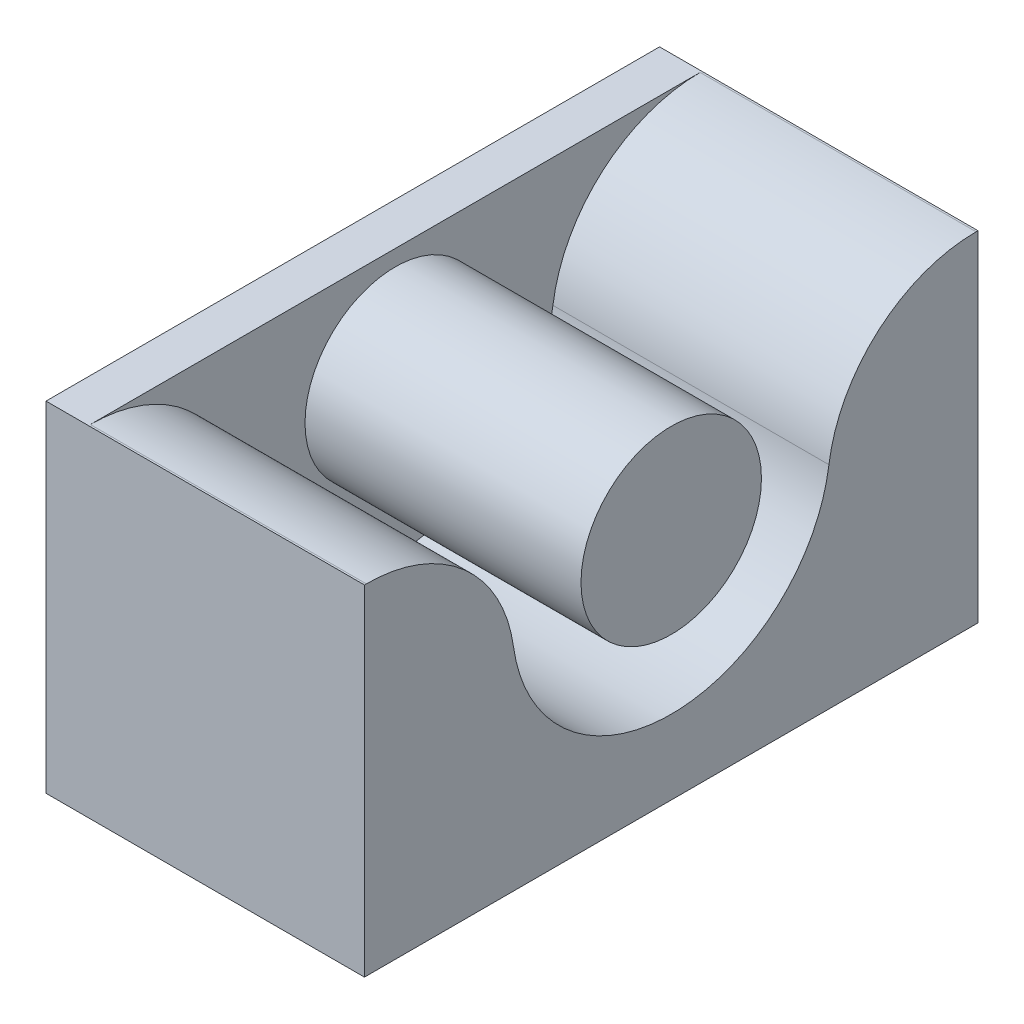
ISO-10303-21;
HEADER;
FILE_DESCRIPTION(('STEP AP214'),'2;1');
FILE_NAME('part.step','',(''),(''),'','','');
FILE_SCHEMA(('AUTOMOTIVE_DESIGN { 1 0 10303 214 1 1 1 1 }'));
ENDSEC;
DATA;
#1=APPLICATION_CONTEXT('core data for automotive mechanical design processes');
#2=APPLICATION_PROTOCOL_DEFINITION('international standard','automotive_design',2000,#1);
#3=PRODUCT_CONTEXT('',#1,'mechanical');
#4=PRODUCT('Part','Part','',(#3));
#5=PRODUCT_RELATED_PRODUCT_CATEGORY('part','',(#4));
#6=PRODUCT_DEFINITION_FORMATION('','',#4);
#7=PRODUCT_DEFINITION_CONTEXT('part definition',#1,'design');
#8=PRODUCT_DEFINITION('design','',#6,#7);
#9=PRODUCT_DEFINITION_SHAPE('','',#8);
#10=(LENGTH_UNIT() NAMED_UNIT(*) SI_UNIT(.MILLI.,.METRE.));
#11=(NAMED_UNIT(*) PLANE_ANGLE_UNIT() SI_UNIT($,.RADIAN.));
#12=(NAMED_UNIT(*) SI_UNIT($,.STERADIAN.) SOLID_ANGLE_UNIT());
#13=UNCERTAINTY_MEASURE_WITH_UNIT(LENGTH_MEASURE(1.E-05),#10,'distance_accuracy_value','');
#14=(GEOMETRIC_REPRESENTATION_CONTEXT(3) GLOBAL_UNCERTAINTY_ASSIGNED_CONTEXT((#13)) GLOBAL_UNIT_ASSIGNED_CONTEXT((#10,
#11,#12)) REPRESENTATION_CONTEXT('',''));
#15=CARTESIAN_POINT('',(0.,0.,0.));
#16=DIRECTION('',(0.,0.,1.));
#17=DIRECTION('',(1.,0.,0.));
#18=AXIS2_PLACEMENT_3D('',#15,#16,#17);
#19=CARTESIAN_POINT('',(2.,0.,0.));
#20=DIRECTION('',(-1.,0.,0.));
#21=DIRECTION('',(0.,0.,1.));
#22=AXIS2_PLACEMENT_3D('',#19,#20,#21);
#23=PLANE('',#22);
#24=CARTESIAN_POINT('',(2.,0.,0.));
#25=DIRECTION('',(-1.,0.,0.));
#26=DIRECTION('',(0.,0.,1.));
#27=AXIS2_PLACEMENT_3D('',#24,#25,#26);
#28=CIRCLE('',#27,4.25);
#29=CARTESIAN_POINT('',(2.,0.,4.25));
#30=VERTEX_POINT('',#29);
#31=EDGE_CURVE('E11',#30,#30,#28,.T.);
#32=ORIENTED_EDGE('',*,*,#31,.T.);
#33=EDGE_LOOP('',(#32));
#34=FACE_BOUND('',#33,.T.);
#35=CARTESIAN_POINT('',(2.,-2.,-14.3614066163451));
#36=DIRECTION('',(-1.,0.,0.));
#37=DIRECTION('',(0.,0.,1.));
#38=AXIS2_PLACEMENT_3D('',#35,#36,#37);
#39=CIRCLE('',#38,7.);
#40=CARTESIAN_POINT('',(2.,5.,-14.3614066163451));
#41=VERTEX_POINT('',#40);
#42=CARTESIAN_POINT('',(2.,-1.03448275862069,-7.42831376707504));
#43=VERTEX_POINT('',#42);
#44=EDGE_CURVE('E149',#41,#43,#39,.F.);
#45=ORIENTED_EDGE('',*,*,#44,.F.);
#46=DIRECTION('',(0.,0.,-1.));
#47=VECTOR('',#46,1.);
#48=CARTESIAN_POINT('',(2.,5.,-14.45));
#49=LINE('',#48,#47);
#50=CARTESIAN_POINT('',(2.,5.,14.3614066163451));
#51=VERTEX_POINT('',#50);
#52=EDGE_CURVE('E151',#51,#41,#49,.T.);
#53=ORIENTED_EDGE('',*,*,#52,.F.);
#54=CARTESIAN_POINT('',(2.,-2.,14.3614066163451));
#55=DIRECTION('',(-1.,0.,0.));
#56=DIRECTION('',(0.,0.,1.));
#57=AXIS2_PLACEMENT_3D('',#54,#55,#56);
#58=CIRCLE('',#57,7.);
#59=CARTESIAN_POINT('',(2.,-1.03448275862069,7.42831376707504));
#60=VERTEX_POINT('',#59);
#61=EDGE_CURVE('E145',#60,#51,#58,.F.);
#62=ORIENTED_EDGE('',*,*,#61,.F.);
#63=CARTESIAN_POINT('',(2.,0.,0.));
#64=DIRECTION('',(-1.,0.,0.));
#65=DIRECTION('',(0.,0.,1.));
#66=AXIS2_PLACEMENT_3D('',#63,#64,#65);
#67=CIRCLE('',#66,7.5);
#68=EDGE_CURVE('E147',#43,#60,#67,.T.);
#69=ORIENTED_EDGE('',*,*,#68,.F.);
#70=EDGE_LOOP('',(#45,#53,#62,#69));
#71=FACE_BOUND('',#70,.T.);
#72=ADVANCED_FACE('F33',(#34,#71),#23,.F.);
#73=CARTESIAN_POINT('',(15.,0.,0.));
#74=DIRECTION('',(-1.,0.,0.));
#75=DIRECTION('',(0.,0.,1.));
#76=AXIS2_PLACEMENT_3D('',#73,#74,#75);
#77=CYLINDRICAL_SURFACE('',#76,4.25);
#78=CARTESIAN_POINT('',(15.,0.,0.));
#79=DIRECTION('',(1.,0.,0.));
#80=DIRECTION('',(0.,0.,-1.));
#81=AXIS2_PLACEMENT_3D('',#78,#79,#80);
#82=CIRCLE('',#81,4.25);
#83=CARTESIAN_POINT('',(15.,0.,-4.25));
#84=VERTEX_POINT('',#83);
#85=EDGE_CURVE('E41',#84,#84,#82,.T.);
#86=ORIENTED_EDGE('',*,*,#85,.F.);
#87=EDGE_LOOP('',(#86));
#88=FACE_BOUND('',#87,.T.);
#89=ORIENTED_EDGE('',*,*,#31,.F.);
#90=EDGE_LOOP('',(#89));
#91=FACE_BOUND('',#90,.T.);
#92=ADVANCED_FACE('F35',(#88,#91),#77,.T.);
#93=CARTESIAN_POINT('',(15.,0.,0.));
#94=DIRECTION('',(1.,0.,0.));
#95=DIRECTION('',(0.,0.,-1.));
#96=AXIS2_PLACEMENT_3D('',#93,#94,#95);
#97=PLANE('',#96);
#98=ORIENTED_EDGE('',*,*,#85,.T.);
#99=EDGE_LOOP('',(#98));
#100=FACE_BOUND('',#99,.T.);
#101=ADVANCED_FACE('F167',(#100),#97,.T.);
#102=CARTESIAN_POINT('',(2.,5.,-14.45));
#103=DIRECTION('',(0.,0.,-1.));
#104=DIRECTION('',(0.,1.,0.));
#105=AXIS2_PLACEMENT_3D('',#102,#103,#104);
#106=PLANE('',#105);
#107=DIRECTION('',(0.,-1.,0.));
#108=VECTOR('',#107,1.);
#109=CARTESIAN_POINT('',(0.,5.,-14.45));
#110=LINE('',#109,#108);
#111=CARTESIAN_POINT('',(0.,5.,-14.45));
#112=VERTEX_POINT('',#111);
#113=CARTESIAN_POINT('',(0.,-11.,-14.45));
#114=VERTEX_POINT('',#113);
#115=EDGE_CURVE('E105',#112,#114,#110,.T.);
#116=ORIENTED_EDGE('',*,*,#115,.F.);
#117=DIRECTION('',(-1.,0.,0.));
#118=VECTOR('',#117,1.);
#119=CARTESIAN_POINT('',(2.,5.,-14.45));
#120=LINE('',#119,#118);
#121=CARTESIAN_POINT('',(15.,5.,-14.45));
#122=VERTEX_POINT('',#121);
#123=EDGE_CURVE('E100',#122,#112,#120,.T.);
#124=ORIENTED_EDGE('',*,*,#123,.F.);
#125=DIRECTION('',(0.,1.,0.));
#126=VECTOR('',#125,1.);
#127=CARTESIAN_POINT('',(15.,5.,-14.45));
#128=LINE('',#127,#126);
#129=CARTESIAN_POINT('',(15.,-11.,-14.45));
#130=VERTEX_POINT('',#129);
#131=EDGE_CURVE('E104',#130,#122,#128,.T.);
#132=ORIENTED_EDGE('',*,*,#131,.F.);
#133=DIRECTION('',(-1.,0.,0.));
#134=VECTOR('',#133,1.);
#135=CARTESIAN_POINT('',(2.,-11.,-14.45));
#136=LINE('',#135,#134);
#137=EDGE_CURVE('E153',#130,#114,#136,.T.);
#138=ORIENTED_EDGE('',*,*,#137,.T.);
#139=EDGE_LOOP('',(#116,#124,#132,#138));
#140=FACE_BOUND('',#139,.T.);
#141=ADVANCED_FACE('F102',(#140),#106,.T.);
#142=CARTESIAN_POINT('',(2.,5.,-14.45));
#143=DIRECTION('',(0.,1.,0.));
#144=DIRECTION('',(0.,0.,1.));
#145=AXIS2_PLACEMENT_3D('',#142,#143,#144);
#146=PLANE('',#145);
#147=DIRECTION('',(-1.,0.,0.));
#148=VECTOR('',#147,1.);
#149=CARTESIAN_POINT('',(15.,5.,14.3614066163451));
#150=LINE('',#149,#148);
#151=CARTESIAN_POINT('',(15.,5.,14.3614066163451));
#152=VERTEX_POINT('',#151);
#153=EDGE_CURVE('E136',#152,#51,#150,.T.);
#154=ORIENTED_EDGE('',*,*,#153,.T.);
#155=ORIENTED_EDGE('',*,*,#52,.T.);
#156=DIRECTION('',(-1.,0.,0.));
#157=VECTOR('',#156,1.);
#158=CARTESIAN_POINT('',(15.,5.,-14.3614066163451));
#159=LINE('',#158,#157);
#160=CARTESIAN_POINT('',(15.,5.,-14.3614066163451));
#161=VERTEX_POINT('',#160);
#162=EDGE_CURVE('E113',#161,#41,#159,.T.);
#163=ORIENTED_EDGE('',*,*,#162,.F.);
#164=DIRECTION('',(0.,0.,1.));
#165=VECTOR('',#164,1.);
#166=CARTESIAN_POINT('',(15.,5.,-14.3614066163451));
#167=LINE('',#166,#165);
#168=EDGE_CURVE('E109',#122,#161,#167,.T.);
#169=ORIENTED_EDGE('',*,*,#168,.F.);
#170=ORIENTED_EDGE('',*,*,#123,.T.);
#171=DIRECTION('',(0.,0.,-1.));
#172=VECTOR('',#171,1.);
#173=CARTESIAN_POINT('',(0.,5.,-14.45));
#174=LINE('',#173,#172);
#175=CARTESIAN_POINT('',(0.,5.,14.45));
#176=VERTEX_POINT('',#175);
#177=EDGE_CURVE('E48',#176,#112,#174,.T.);
#178=ORIENTED_EDGE('',*,*,#177,.F.);
#179=DIRECTION('',(-1.,0.,0.));
#180=VECTOR('',#179,1.);
#181=CARTESIAN_POINT('',(2.,5.,14.45));
#182=LINE('',#181,#180);
#183=CARTESIAN_POINT('',(15.,5.,14.45));
#184=VERTEX_POINT('',#183);
#185=EDGE_CURVE('E56',#184,#176,#182,.T.);
#186=ORIENTED_EDGE('',*,*,#185,.F.);
#187=DIRECTION('',(0.,0.,1.));
#188=VECTOR('',#187,1.);
#189=CARTESIAN_POINT('',(15.,5.,14.45));
#190=LINE('',#189,#188);
#191=EDGE_CURVE('E130',#152,#184,#190,.T.);
#192=ORIENTED_EDGE('',*,*,#191,.F.);
#193=EDGE_LOOP('',(#154,#155,#163,#169,#170,#178,#186,#192));
#194=FACE_BOUND('',#193,.T.);
#195=ADVANCED_FACE('F111',(#194),#146,.T.);
#196=CARTESIAN_POINT('',(2.,5.,14.45));
#197=DIRECTION('',(0.,0.,1.));
#198=DIRECTION('',(1.,0.,0.));
#199=AXIS2_PLACEMENT_3D('',#196,#197,#198);
#200=PLANE('',#199);
#201=DIRECTION('',(0.,1.,0.));
#202=VECTOR('',#201,1.);
#203=CARTESIAN_POINT('',(0.,5.,14.45));
#204=LINE('',#203,#202);
#205=CARTESIAN_POINT('',(0.,-11.,14.45));
#206=VERTEX_POINT('',#205);
#207=EDGE_CURVE('E158',#206,#176,#204,.T.);
#208=ORIENTED_EDGE('',*,*,#207,.F.);
#209=DIRECTION('',(-1.,0.,0.));
#210=VECTOR('',#209,1.);
#211=CARTESIAN_POINT('',(2.,-11.,14.45));
#212=LINE('',#211,#210);
#213=CARTESIAN_POINT('',(15.,-11.,14.45));
#214=VERTEX_POINT('',#213);
#215=EDGE_CURVE('E162',#214,#206,#212,.T.);
#216=ORIENTED_EDGE('',*,*,#215,.F.);
#217=DIRECTION('',(0.,-1.,0.));
#218=VECTOR('',#217,1.);
#219=CARTESIAN_POINT('',(15.,5.,14.45));
#220=LINE('',#219,#218);
#221=EDGE_CURVE('E133',#184,#214,#220,.T.);
#222=ORIENTED_EDGE('',*,*,#221,.F.);
#223=ORIENTED_EDGE('',*,*,#185,.T.);
#224=EDGE_LOOP('',(#208,#216,#222,#223));
#225=FACE_BOUND('',#224,.T.);
#226=ADVANCED_FACE('F192',(#225),#200,.T.);
#227=CARTESIAN_POINT('',(2.,-11.,-14.45));
#228=DIRECTION('',(0.,-1.,0.));
#229=DIRECTION('',(0.,0.,-1.));
#230=AXIS2_PLACEMENT_3D('',#227,#228,#229);
#231=PLANE('',#230);
#232=DIRECTION('',(0.,0.,1.));
#233=VECTOR('',#232,1.);
#234=CARTESIAN_POINT('',(0.,-11.,-14.45));
#235=LINE('',#234,#233);
#236=EDGE_CURVE('E155',#114,#206,#235,.T.);
#237=ORIENTED_EDGE('',*,*,#236,.F.);
#238=ORIENTED_EDGE('',*,*,#137,.F.);
#239=DIRECTION('',(0.,0.,-1.));
#240=VECTOR('',#239,1.);
#241=CARTESIAN_POINT('',(15.,-11.,14.45));
#242=LINE('',#241,#240);
#243=EDGE_CURVE('E122',#214,#130,#242,.T.);
#244=ORIENTED_EDGE('',*,*,#243,.F.);
#245=ORIENTED_EDGE('',*,*,#215,.T.);
#246=EDGE_LOOP('',(#237,#238,#244,#245));
#247=FACE_BOUND('',#246,.T.);
#248=ADVANCED_FACE('F195',(#247),#231,.T.);
#249=CARTESIAN_POINT('',(0.,0.,0.));
#250=DIRECTION('',(1.,0.,0.));
#251=DIRECTION('',(0.,0.,-1.));
#252=AXIS2_PLACEMENT_3D('',#249,#250,#251);
#253=PLANE('',#252);
#254=ORIENTED_EDGE('',*,*,#177,.T.);
#255=ORIENTED_EDGE('',*,*,#115,.T.);
#256=ORIENTED_EDGE('',*,*,#236,.T.);
#257=ORIENTED_EDGE('',*,*,#207,.T.);
#258=EDGE_LOOP('',(#254,#255,#256,#257));
#259=FACE_BOUND('',#258,.T.);
#260=ADVANCED_FACE('F196',(#259),#253,.F.);
#261=CARTESIAN_POINT('',(15.,-2.,-14.3614066163451));
#262=DIRECTION('',(-1.,0.,0.));
#263=DIRECTION('',(0.,0.,1.));
#264=AXIS2_PLACEMENT_3D('',#261,#262,#263);
#265=CYLINDRICAL_SURFACE('',#264,7.);
#266=ORIENTED_EDGE('',*,*,#162,.T.);
#267=ORIENTED_EDGE('',*,*,#44,.T.);
#268=DIRECTION('',(-1.,0.,0.));
#269=VECTOR('',#268,1.);
#270=CARTESIAN_POINT('',(15.,-1.03448275862069,-7.42831376707504));
#271=LINE('',#270,#269);
#272=CARTESIAN_POINT('',(15.,-1.03448275862069,-7.42831376707504));
#273=VERTEX_POINT('',#272);
#274=EDGE_CURVE('E141',#273,#43,#271,.T.);
#275=ORIENTED_EDGE('',*,*,#274,.F.);
#276=CARTESIAN_POINT('',(15.,-2.,-14.3614066163451));
#277=DIRECTION('',(1.,0.,0.));
#278=DIRECTION('',(0.,0.,-1.));
#279=AXIS2_PLACEMENT_3D('',#276,#277,#278);
#280=CIRCLE('',#279,7.);
#281=EDGE_CURVE('E116',#161,#273,#280,.T.);
#282=ORIENTED_EDGE('',*,*,#281,.F.);
#283=EDGE_LOOP('',(#266,#267,#275,#282));
#284=FACE_BOUND('',#283,.T.);
#285=ADVANCED_FACE('F191',(#284),#265,.T.);
#286=CARTESIAN_POINT('',(15.,0.,0.));
#287=DIRECTION('',(-1.,0.,0.));
#288=DIRECTION('',(0.,0.,1.));
#289=AXIS2_PLACEMENT_3D('',#286,#287,#288);
#290=CYLINDRICAL_SURFACE('',#289,7.5);
#291=ORIENTED_EDGE('',*,*,#274,.T.);
#292=ORIENTED_EDGE('',*,*,#68,.T.);
#293=DIRECTION('',(-1.,0.,0.));
#294=VECTOR('',#293,1.);
#295=CARTESIAN_POINT('',(15.,-1.03448275862069,7.42831376707504));
#296=LINE('',#295,#294);
#297=CARTESIAN_POINT('',(15.,-1.03448275862069,7.42831376707504));
#298=VERTEX_POINT('',#297);
#299=EDGE_CURVE('E138',#298,#60,#296,.T.);
#300=ORIENTED_EDGE('',*,*,#299,.F.);
#301=CARTESIAN_POINT('',(15.,0.,0.));
#302=DIRECTION('',(-1.,0.,0.));
#303=DIRECTION('',(0.,0.,-1.));
#304=AXIS2_PLACEMENT_3D('',#301,#302,#303);
#305=CIRCLE('',#304,7.5);
#306=EDGE_CURVE('E126',#273,#298,#305,.T.);
#307=ORIENTED_EDGE('',*,*,#306,.F.);
#308=EDGE_LOOP('',(#291,#292,#300,#307));
#309=FACE_BOUND('',#308,.T.);
#310=ADVANCED_FACE('F190',(#309),#290,.F.);
#311=CARTESIAN_POINT('',(15.,-2.,14.3614066163451));
#312=DIRECTION('',(-1.,0.,0.));
#313=DIRECTION('',(0.,0.,1.));
#314=AXIS2_PLACEMENT_3D('',#311,#312,#313);
#315=CYLINDRICAL_SURFACE('',#314,7.);
#316=ORIENTED_EDGE('',*,*,#299,.T.);
#317=ORIENTED_EDGE('',*,*,#61,.T.);
#318=ORIENTED_EDGE('',*,*,#153,.F.);
#319=CARTESIAN_POINT('',(15.,-2.,14.3614066163451));
#320=DIRECTION('',(1.,0.,0.));
#321=DIRECTION('',(0.,0.,1.));
#322=AXIS2_PLACEMENT_3D('',#319,#320,#321);
#323=CIRCLE('',#322,7.);
#324=EDGE_CURVE('E128',#298,#152,#323,.T.);
#325=ORIENTED_EDGE('',*,*,#324,.F.);
#326=EDGE_LOOP('',(#316,#317,#318,#325));
#327=FACE_BOUND('',#326,.T.);
#328=ADVANCED_FACE('F186',(#327),#315,.T.);
#329=CARTESIAN_POINT('',(15.,-2.,14.3614066163451));
#330=DIRECTION('',(-1.,0.,0.));
#331=DIRECTION('',(0.,0.,1.));
#332=AXIS2_PLACEMENT_3D('',#329,#330,#331);
#333=PLANE('',#332);
#334=ORIENTED_EDGE('',*,*,#131,.T.);
#335=ORIENTED_EDGE('',*,*,#168,.T.);
#336=ORIENTED_EDGE('',*,*,#281,.T.);
#337=ORIENTED_EDGE('',*,*,#306,.T.);
#338=ORIENTED_EDGE('',*,*,#324,.T.);
#339=ORIENTED_EDGE('',*,*,#191,.T.);
#340=ORIENTED_EDGE('',*,*,#221,.T.);
#341=ORIENTED_EDGE('',*,*,#243,.T.);
#342=EDGE_LOOP('',(#334,#335,#336,#337,#338,#339,#340,#341));
#343=FACE_BOUND('',#342,.T.);
#344=ADVANCED_FACE('F119',(#343),#333,.F.);
#345=CLOSED_SHELL('',(#72,#92,#101,#141,#195,#226,#248,#260,#285,#310,#328,#344));
#346=MANIFOLD_SOLID_BREP('B2',#345);
#347=ADVANCED_BREP_SHAPE_REPRESENTATION('',(#18,#346),#14);
#348=SHAPE_DEFINITION_REPRESENTATION(#9,#347);
ENDSEC;
END-ISO-10303-21;
